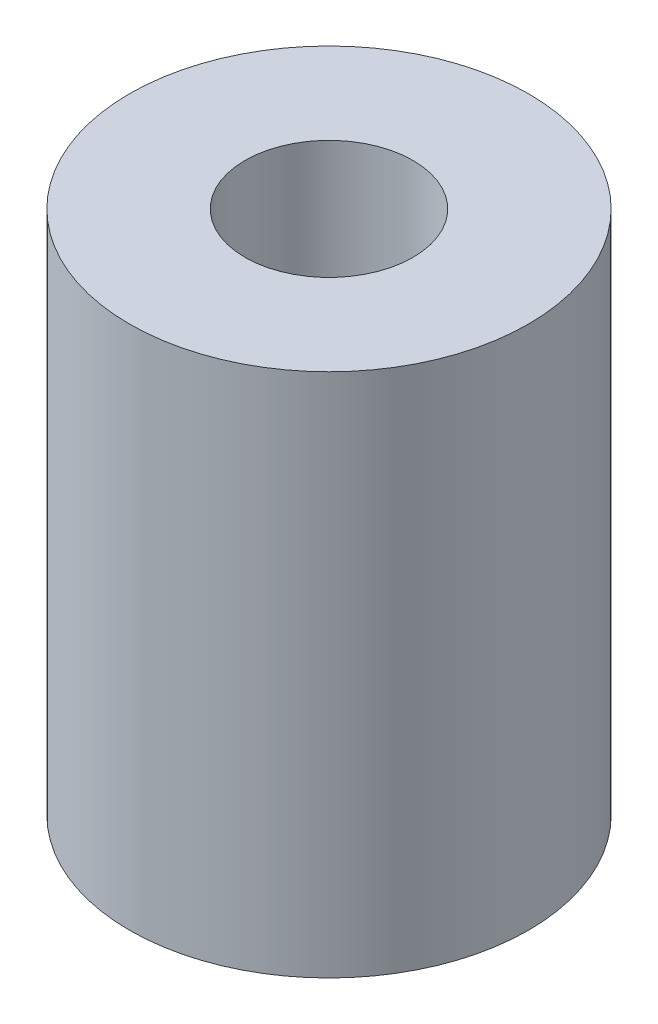
ISO-10303-21;
HEADER;
FILE_DESCRIPTION(('STEP AP214'),'2;1');
FILE_NAME('part.step','',(''),(''),'','','');
FILE_SCHEMA(('AUTOMOTIVE_DESIGN { 1 0 10303 214 1 1 1 1 }'));
ENDSEC;
DATA;
#1=APPLICATION_CONTEXT('core data for automotive mechanical design processes');
#2=APPLICATION_PROTOCOL_DEFINITION('international standard','automotive_design',2000,#1);
#3=PRODUCT_CONTEXT('',#1,'mechanical');
#4=PRODUCT('Part','Part','',(#3));
#5=PRODUCT_RELATED_PRODUCT_CATEGORY('part','',(#4));
#6=PRODUCT_DEFINITION_FORMATION('','',#4);
#7=PRODUCT_DEFINITION_CONTEXT('part definition',#1,'design');
#8=PRODUCT_DEFINITION('design','',#6,#7);
#9=PRODUCT_DEFINITION_SHAPE('','',#8);
#10=(LENGTH_UNIT() NAMED_UNIT(*) SI_UNIT(.MILLI.,.METRE.));
#11=(NAMED_UNIT(*) PLANE_ANGLE_UNIT() SI_UNIT($,.RADIAN.));
#12=(NAMED_UNIT(*) SI_UNIT($,.STERADIAN.) SOLID_ANGLE_UNIT());
#13=UNCERTAINTY_MEASURE_WITH_UNIT(LENGTH_MEASURE(1.E-05),#10,'distance_accuracy_value','');
#14=(GEOMETRIC_REPRESENTATION_CONTEXT(3) GLOBAL_UNCERTAINTY_ASSIGNED_CONTEXT((#13)) GLOBAL_UNIT_ASSIGNED_CONTEXT((#10,
#11,#12)) REPRESENTATION_CONTEXT('',''));
#15=CARTESIAN_POINT('',(0.,0.,0.));
#16=DIRECTION('',(0.,0.,1.));
#17=DIRECTION('',(1.,0.,0.));
#18=AXIS2_PLACEMENT_3D('',#15,#16,#17);
#19=CARTESIAN_POINT('',(0.,25.,0.));
#20=DIRECTION('',(0.,-1.,0.));
#21=DIRECTION('',(0.,0.,-1.));
#22=AXIS2_PLACEMENT_3D('',#19,#20,#21);
#23=CYLINDRICAL_SURFACE('',#22,9.5);
#24=CARTESIAN_POINT('',(0.,25.,0.));
#25=DIRECTION('',(0.,1.,0.));
#26=DIRECTION('',(0.,0.,1.));
#27=AXIS2_PLACEMENT_3D('',#24,#25,#26);
#28=CIRCLE('',#27,9.5);
#29=CARTESIAN_POINT('',(0.,25.,9.5));
#30=VERTEX_POINT('',#29);
#31=EDGE_CURVE('E10',#30,#30,#28,.T.);
#32=ORIENTED_EDGE('',*,*,#31,.F.);
#33=EDGE_LOOP('',(#32));
#34=FACE_BOUND('',#33,.T.);
#35=CARTESIAN_POINT('',(0.,0.,0.));
#36=DIRECTION('',(0.,1.,0.));
#37=DIRECTION('',(0.,0.,1.));
#38=AXIS2_PLACEMENT_3D('',#35,#36,#37);
#39=CIRCLE('',#38,9.5);
#40=CARTESIAN_POINT('',(0.,0.,9.5));
#41=VERTEX_POINT('',#40);
#42=EDGE_CURVE('E38',#41,#41,#39,.T.);
#43=ORIENTED_EDGE('',*,*,#42,.T.);
#44=EDGE_LOOP('',(#43));
#45=FACE_BOUND('',#44,.T.);
#46=ADVANCED_FACE('F35',(#34,#45),#23,.T.);
#47=CARTESIAN_POINT('',(0.,25.,0.));
#48=DIRECTION('',(0.,1.,0.));
#49=DIRECTION('',(0.,0.,1.));
#50=AXIS2_PLACEMENT_3D('',#47,#48,#49);
#51=PLANE('',#50);
#52=CARTESIAN_POINT('',(0.,25.,0.));
#53=DIRECTION('',(0.,1.,0.));
#54=DIRECTION('',(0.,0.,1.));
#55=AXIS2_PLACEMENT_3D('',#52,#53,#54);
#56=CIRCLE('',#55,4.);
#57=CARTESIAN_POINT('',(0.,25.,4.));
#58=VERTEX_POINT('',#57);
#59=EDGE_CURVE('E47',#58,#58,#56,.T.);
#60=ORIENTED_EDGE('',*,*,#59,.F.);
#61=EDGE_LOOP('',(#60));
#62=FACE_BOUND('',#61,.T.);
#63=ORIENTED_EDGE('',*,*,#31,.T.);
#64=EDGE_LOOP('',(#63));
#65=FACE_BOUND('',#64,.T.);
#66=ADVANCED_FACE('F72',(#62,#65),#51,.T.);
#67=CARTESIAN_POINT('',(0.,0.,0.));
#68=DIRECTION('',(0.,1.,0.));
#69=DIRECTION('',(0.,0.,1.));
#70=AXIS2_PLACEMENT_3D('',#67,#68,#69);
#71=PLANE('',#70);
#72=CARTESIAN_POINT('',(0.,0.,0.));
#73=DIRECTION('',(0.,-1.,0.));
#74=DIRECTION('',(0.,0.,-1.));
#75=AXIS2_PLACEMENT_3D('',#72,#73,#74);
#76=CIRCLE('',#75,2.5);
#77=CARTESIAN_POINT('',(0.,0.,-2.5));
#78=VERTEX_POINT('',#77);
#79=EDGE_CURVE('E53',#78,#78,#76,.T.);
#80=ORIENTED_EDGE('',*,*,#79,.F.);
#81=EDGE_LOOP('',(#80));
#82=FACE_BOUND('',#81,.T.);
#83=ORIENTED_EDGE('',*,*,#42,.F.);
#84=EDGE_LOOP('',(#83));
#85=FACE_BOUND('',#84,.T.);
#86=ADVANCED_FACE('F68',(#82,#85),#71,.F.);
#87=CARTESIAN_POINT('',(0.,12.5,0.));
#88=DIRECTION('',(0.,1.,0.));
#89=DIRECTION('',(0.,0.,1.));
#90=AXIS2_PLACEMENT_3D('',#87,#88,#89);
#91=CYLINDRICAL_SURFACE('',#90,4.);
#92=CARTESIAN_POINT('',(0.,12.5,0.));
#93=DIRECTION('',(0.,1.,0.));
#94=DIRECTION('',(0.,0.,1.));
#95=AXIS2_PLACEMENT_3D('',#92,#93,#94);
#96=CIRCLE('',#95,4.);
#97=CARTESIAN_POINT('',(0.,12.5,4.));
#98=VERTEX_POINT('',#97);
#99=EDGE_CURVE('E45',#98,#98,#96,.T.);
#100=ORIENTED_EDGE('',*,*,#99,.F.);
#101=EDGE_LOOP('',(#100));
#102=FACE_BOUND('',#101,.T.);
#103=ORIENTED_EDGE('',*,*,#59,.T.);
#104=EDGE_LOOP('',(#103));
#105=FACE_BOUND('',#104,.T.);
#106=ADVANCED_FACE('F71',(#102,#105),#91,.F.);
#107=CARTESIAN_POINT('',(0.,12.5,0.));
#108=DIRECTION('',(0.,1.,0.));
#109=DIRECTION('',(0.,0.,1.));
#110=AXIS2_PLACEMENT_3D('',#107,#108,#109);
#111=PLANE('',#110);
#112=CARTESIAN_POINT('',(0.,12.5,0.));
#113=DIRECTION('',(0.,-1.,0.));
#114=DIRECTION('',(0.,0.,-1.));
#115=AXIS2_PLACEMENT_3D('',#112,#113,#114);
#116=CIRCLE('',#115,2.5);
#117=CARTESIAN_POINT('',(0.,12.5,-2.5));
#118=VERTEX_POINT('',#117);
#119=EDGE_CURVE('E50',#118,#118,#116,.T.);
#120=ORIENTED_EDGE('',*,*,#119,.T.);
#121=EDGE_LOOP('',(#120));
#122=FACE_BOUND('',#121,.T.);
#123=ORIENTED_EDGE('',*,*,#99,.T.);
#124=EDGE_LOOP('',(#123));
#125=FACE_BOUND('',#124,.T.);
#126=ADVANCED_FACE('F59',(#122,#125),#111,.T.);
#127=CARTESIAN_POINT('',(0.,12.5,0.));
#128=DIRECTION('',(0.,-1.,0.));
#129=DIRECTION('',(0.,0.,-1.));
#130=AXIS2_PLACEMENT_3D('',#127,#128,#129);
#131=CYLINDRICAL_SURFACE('',#130,2.5);
#132=ORIENTED_EDGE('',*,*,#119,.F.);
#133=EDGE_LOOP('',(#132));
#134=FACE_BOUND('',#133,.T.);
#135=ORIENTED_EDGE('',*,*,#79,.T.);
#136=EDGE_LOOP('',(#135));
#137=FACE_BOUND('',#136,.T.);
#138=ADVANCED_FACE('F62',(#134,#137),#131,.F.);
#139=CLOSED_SHELL('',(#46,#66,#86,#106,#126,#138));
#140=MANIFOLD_SOLID_BREP('B2',#139);
#141=ADVANCED_BREP_SHAPE_REPRESENTATION('',(#18,#140),#14);
#142=SHAPE_DEFINITION_REPRESENTATION(#9,#141);
ENDSEC;
END-ISO-10303-21;
